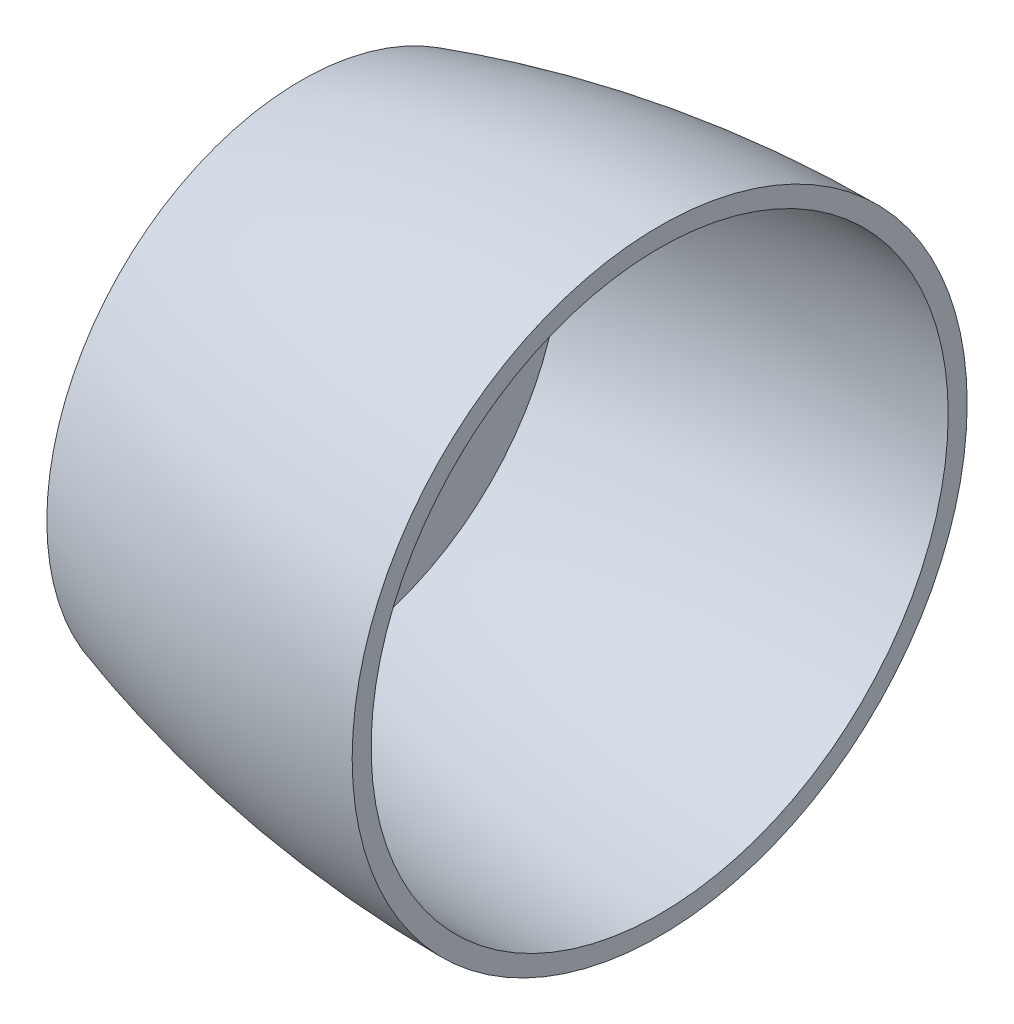
ISO-10303-21;
HEADER;
FILE_DESCRIPTION(('STEP AP214'),'2;1');
FILE_NAME('part.step','',(''),(''),'','','');
FILE_SCHEMA(('AUTOMOTIVE_DESIGN { 1 0 10303 214 1 1 1 1 }'));
ENDSEC;
DATA;
#1=APPLICATION_CONTEXT('core data for automotive mechanical design processes');
#2=APPLICATION_PROTOCOL_DEFINITION('international standard','automotive_design',2000,#1);
#3=PRODUCT_CONTEXT('',#1,'mechanical');
#4=PRODUCT('Part','Part','',(#3));
#5=PRODUCT_RELATED_PRODUCT_CATEGORY('part','',(#4));
#6=PRODUCT_DEFINITION_FORMATION('','',#4);
#7=PRODUCT_DEFINITION_CONTEXT('part definition',#1,'design');
#8=PRODUCT_DEFINITION('design','',#6,#7);
#9=PRODUCT_DEFINITION_SHAPE('','',#8);
#10=(LENGTH_UNIT() NAMED_UNIT(*) SI_UNIT(.MILLI.,.METRE.));
#11=(NAMED_UNIT(*) PLANE_ANGLE_UNIT() SI_UNIT($,.RADIAN.));
#12=(NAMED_UNIT(*) SI_UNIT($,.STERADIAN.) SOLID_ANGLE_UNIT());
#13=UNCERTAINTY_MEASURE_WITH_UNIT(LENGTH_MEASURE(1.E-05),#10,'distance_accuracy_value','');
#14=(GEOMETRIC_REPRESENTATION_CONTEXT(3) GLOBAL_UNCERTAINTY_ASSIGNED_CONTEXT((#13)) GLOBAL_UNIT_ASSIGNED_CONTEXT((#10,
#11,#12)) REPRESENTATION_CONTEXT('',''));
#15=CARTESIAN_POINT('',(0.,0.,0.));
#16=DIRECTION('',(0.,0.,1.));
#17=DIRECTION('',(1.,0.,0.));
#18=AXIS2_PLACEMENT_3D('',#15,#16,#17);
#19=CARTESIAN_POINT('',(0.,16.2179897640092,0.));
#20=DIRECTION('',(1.,0.,0.));
#21=DIRECTION('',(0.,0.,-1.));
#22=AXIS2_PLACEMENT_3D('',#19,#20,#21);
#23=PLANE('',#22);
#24=CARTESIAN_POINT('',(0.,0.,0.));
#25=DIRECTION('',(1.,0.,0.));
#26=DIRECTION('',(0.,0.,-1.));
#27=AXIS2_PLACEMENT_3D('',#24,#25,#26);
#28=CIRCLE('',#27,15.2179897640092);
#29=CARTESIAN_POINT('',(0.,0.,-15.2179897640092));
#30=VERTEX_POINT('',#29);
#31=EDGE_CURVE('E35',#30,#30,#28,.T.);
#32=ORIENTED_EDGE('',*,*,#31,.F.);
#33=EDGE_LOOP('',(#32));
#34=FACE_BOUND('',#33,.T.);
#35=CARTESIAN_POINT('',(0.,0.,0.));
#36=DIRECTION('',(1.,0.,0.));
#37=DIRECTION('',(0.,0.,-1.));
#38=AXIS2_PLACEMENT_3D('',#35,#36,#37);
#39=CIRCLE('',#38,16.2179897640092);
#40=CARTESIAN_POINT('',(0.,0.,-16.2179897640092));
#41=VERTEX_POINT('',#40);
#42=EDGE_CURVE('E10',#41,#41,#39,.T.);
#43=ORIENTED_EDGE('',*,*,#42,.T.);
#44=EDGE_LOOP('',(#43));
#45=FACE_BOUND('',#44,.T.);
#46=ADVANCED_FACE('F32',(#34,#45),#23,.T.);
#47=CARTESIAN_POINT('',(0.,0.,0.));
#48=DIRECTION('',(1.,0.,0.));
#49=DIRECTION('',(0.,0.,-1.));
#50=AXIS2_PLACEMENT_3D('',#47,#48,#49);
#51=DEGENERATE_TOROIDAL_SURFACE('',#50,48.7820102359908,65.,.F.);
#52=CARTESIAN_POINT('',(-18.9164281281048,0.,0.));
#53=DIRECTION('',(1.,0.,0.));
#54=DIRECTION('',(0.,0.,-1.));
#55=AXIS2_PLACEMENT_3D('',#52,#53,#54);
#56=CIRCLE('',#55,13.4045538021859);
#57=CARTESIAN_POINT('',(-18.9164281281048,0.,-13.4045538021859));
#58=VERTEX_POINT('',#57);
#59=EDGE_CURVE('E39',#58,#58,#56,.T.);
#60=ORIENTED_EDGE('',*,*,#59,.T.);
#61=EDGE_LOOP('',(#60));
#62=FACE_BOUND('',#61,.T.);
#63=ORIENTED_EDGE('',*,*,#42,.F.);
#64=EDGE_LOOP('',(#63));
#65=FACE_BOUND('',#64,.T.);
#66=ADVANCED_FACE('F84',(#62,#65),#51,.F.);
#67=CARTESIAN_POINT('',(-18.9164281281048,0.,0.));
#68=DIRECTION('',(-1.,0.,0.));
#69=DIRECTION('',(0.,0.,1.));
#70=AXIS2_PLACEMENT_3D('',#67,#68,#69);
#71=PLANE('',#70);
#72=CARTESIAN_POINT('',(-18.9164281281048,0.,0.));
#73=DIRECTION('',(-1.,0.,0.));
#74=DIRECTION('',(0.,0.,1.));
#75=AXIS2_PLACEMENT_3D('',#72,#73,#74);
#76=CIRCLE('',#75,1.25);
#77=CARTESIAN_POINT('',(-18.9164281281048,0.,1.25));
#78=VERTEX_POINT('',#77);
#79=EDGE_CURVE('E57',#78,#78,#76,.F.);
#80=ORIENTED_EDGE('',*,*,#79,.T.);
#81=EDGE_LOOP('',(#80));
#82=FACE_BOUND('',#81,.T.);
#83=ORIENTED_EDGE('',*,*,#59,.F.);
#84=EDGE_LOOP('',(#83));
#85=FACE_BOUND('',#84,.T.);
#86=ADVANCED_FACE('F61',(#82,#85),#71,.T.);
#87=CARTESIAN_POINT('',(0.,0.,0.));
#88=DIRECTION('',(1.,0.,0.));
#89=DIRECTION('',(0.,0.,-1.));
#90=AXIS2_PLACEMENT_3D('',#87,#88,#89);
#91=DEGENERATE_TOROIDAL_SURFACE('',#90,49.7820102359908,65.,.F.);
#92=ORIENTED_EDGE('',*,*,#31,.T.);
#93=EDGE_LOOP('',(#92));
#94=FACE_BOUND('',#93,.T.);
#95=CARTESIAN_POINT('',(-17.9164281281048,0.,0.));
#96=DIRECTION('',(1.,0.,0.));
#97=DIRECTION('',(0.,0.,-1.));
#98=AXIS2_PLACEMENT_3D('',#95,#96,#97);
#99=CIRCLE('',#98,12.7);
#100=CARTESIAN_POINT('',(-17.9164281281048,0.,-12.7));
#101=VERTEX_POINT('',#100);
#102=EDGE_CURVE('E45',#101,#101,#99,.T.);
#103=ORIENTED_EDGE('',*,*,#102,.F.);
#104=EDGE_LOOP('',(#103));
#105=FACE_BOUND('',#104,.T.);
#106=ADVANCED_FACE('F93',(#94,#105),#91,.T.);
#107=CARTESIAN_POINT('',(-17.9164281281048,7.99999999999999,0.));
#108=DIRECTION('',(-1.,0.,0.));
#109=DIRECTION('',(0.,0.,1.));
#110=AXIS2_PLACEMENT_3D('',#107,#108,#109);
#111=PLANE('',#110);
#112=CARTESIAN_POINT('',(-17.9164281281048,0.,0.));
#113=DIRECTION('',(1.,0.,0.));
#114=DIRECTION('',(0.,0.,-1.));
#115=AXIS2_PLACEMENT_3D('',#112,#113,#114);
#116=CIRCLE('',#115,7.99999999999999);
#117=CARTESIAN_POINT('',(-17.9164281281048,0.,-7.99999999999999));
#118=VERTEX_POINT('',#117);
#119=EDGE_CURVE('E48',#118,#118,#116,.T.);
#120=ORIENTED_EDGE('',*,*,#119,.F.);
#121=EDGE_LOOP('',(#120));
#122=FACE_BOUND('',#121,.T.);
#123=ORIENTED_EDGE('',*,*,#102,.T.);
#124=EDGE_LOOP('',(#123));
#125=FACE_BOUND('',#124,.T.);
#126=ADVANCED_FACE('F78',(#122,#125),#111,.F.);
#127=CARTESIAN_POINT('',(17.9164281281048,0.,0.));
#128=DIRECTION('',(1.,0.,0.));
#129=DIRECTION('',(0.,0.,-1.));
#130=AXIS2_PLACEMENT_3D('',#127,#128,#129);
#131=CYLINDRICAL_SURFACE('',#130,7.99999999999999);
#132=CARTESIAN_POINT('',(-17.4164281281047,0.,0.));
#133=DIRECTION('',(1.,0.,0.));
#134=DIRECTION('',(0.,0.,-1.));
#135=AXIS2_PLACEMENT_3D('',#132,#133,#134);
#136=CIRCLE('',#135,7.99999999999999);
#137=CARTESIAN_POINT('',(-17.4164281281047,0.,-7.99999999999999));
#138=VERTEX_POINT('',#137);
#139=EDGE_CURVE('E51',#138,#138,#136,.T.);
#140=ORIENTED_EDGE('',*,*,#139,.F.);
#141=EDGE_LOOP('',(#140));
#142=FACE_BOUND('',#141,.T.);
#143=ORIENTED_EDGE('',*,*,#119,.T.);
#144=EDGE_LOOP('',(#143));
#145=FACE_BOUND('',#144,.T.);
#146=ADVANCED_FACE('F72',(#142,#145),#131,.T.);
#147=CARTESIAN_POINT('',(-17.4164281281047,1.25,0.));
#148=DIRECTION('',(-1.,0.,0.));
#149=DIRECTION('',(0.,0.,1.));
#150=AXIS2_PLACEMENT_3D('',#147,#148,#149);
#151=PLANE('',#150);
#152=ORIENTED_EDGE('',*,*,#139,.T.);
#153=EDGE_LOOP('',(#152));
#154=FACE_BOUND('',#153,.T.);
#155=CARTESIAN_POINT('',(-17.4164281281047,0.,0.));
#156=DIRECTION('',(-1.,0.,0.));
#157=DIRECTION('',(0.,0.,1.));
#158=AXIS2_PLACEMENT_3D('',#155,#156,#157);
#159=CIRCLE('',#158,1.25);
#160=CARTESIAN_POINT('',(-17.4164281281047,0.,1.25));
#161=VERTEX_POINT('',#160);
#162=EDGE_CURVE('E54',#161,#161,#159,.T.);
#163=ORIENTED_EDGE('',*,*,#162,.T.);
#164=EDGE_LOOP('',(#163));
#165=FACE_BOUND('',#164,.T.);
#166=ADVANCED_FACE('F67',(#154,#165),#151,.F.);
#167=CARTESIAN_POINT('',(-18.9174281281048,0.,0.));
#168=DIRECTION('',(1.,0.,0.));
#169=DIRECTION('',(0.,0.,-1.));
#170=AXIS2_PLACEMENT_3D('',#167,#168,#169);
#171=CYLINDRICAL_SURFACE('',#170,1.25);
#172=ORIENTED_EDGE('',*,*,#79,.F.);
#173=EDGE_LOOP('',(#172));
#174=FACE_BOUND('',#173,.T.);
#175=ORIENTED_EDGE('',*,*,#162,.F.);
#176=EDGE_LOOP('',(#175));
#177=FACE_BOUND('',#176,.T.);
#178=ADVANCED_FACE('F64',(#174,#177),#171,.F.);
#179=CLOSED_SHELL('',(#46,#66,#86,#106,#126,#146,#166,#178));
#180=MANIFOLD_SOLID_BREP('B2',#179);
#181=ADVANCED_BREP_SHAPE_REPRESENTATION('',(#18,#180),#14);
#182=SHAPE_DEFINITION_REPRESENTATION(#9,#181);
ENDSEC;
END-ISO-10303-21;
